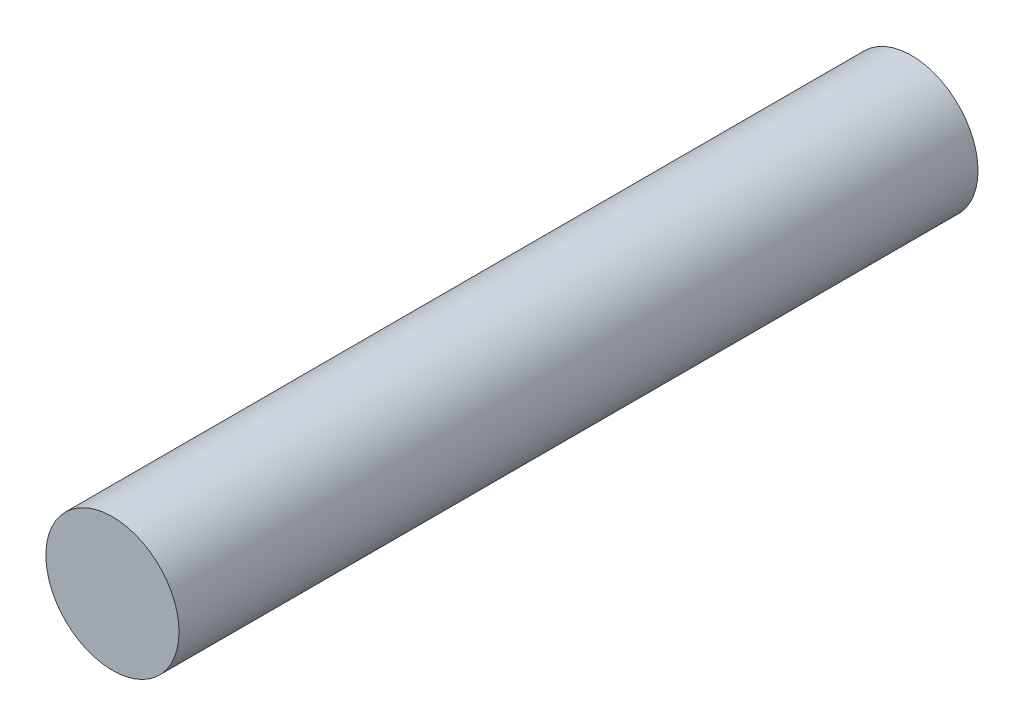
ISO-10303-21;
HEADER;
FILE_DESCRIPTION(('STEP AP214'),'2;1');
FILE_NAME('part.step','',(''),(''),'','','');
FILE_SCHEMA(('AUTOMOTIVE_DESIGN { 1 0 10303 214 1 1 1 1 }'));
ENDSEC;
DATA;
#1=APPLICATION_CONTEXT('core data for automotive mechanical design processes');
#2=APPLICATION_PROTOCOL_DEFINITION('international standard','automotive_design',2000,#1);
#3=PRODUCT_CONTEXT('',#1,'mechanical');
#4=PRODUCT('Part','Part','',(#3));
#5=PRODUCT_RELATED_PRODUCT_CATEGORY('part','',(#4));
#6=PRODUCT_DEFINITION_FORMATION('','',#4);
#7=PRODUCT_DEFINITION_CONTEXT('part definition',#1,'design');
#8=PRODUCT_DEFINITION('design','',#6,#7);
#9=PRODUCT_DEFINITION_SHAPE('','',#8);
#10=(LENGTH_UNIT() NAMED_UNIT(*) SI_UNIT(.MILLI.,.METRE.));
#11=(NAMED_UNIT(*) PLANE_ANGLE_UNIT() SI_UNIT($,.RADIAN.));
#12=(NAMED_UNIT(*) SI_UNIT($,.STERADIAN.) SOLID_ANGLE_UNIT());
#13=UNCERTAINTY_MEASURE_WITH_UNIT(LENGTH_MEASURE(1.E-05),#10,'distance_accuracy_value','');
#14=(GEOMETRIC_REPRESENTATION_CONTEXT(3) GLOBAL_UNCERTAINTY_ASSIGNED_CONTEXT((#13)) GLOBAL_UNIT_ASSIGNED_CONTEXT((#10,
#11,#12)) REPRESENTATION_CONTEXT('',''));
#15=CARTESIAN_POINT('',(0.,0.,0.));
#16=DIRECTION('',(0.,0.,1.));
#17=DIRECTION('',(1.,0.,0.));
#18=AXIS2_PLACEMENT_3D('',#15,#16,#17);
#19=CARTESIAN_POINT('',(0.,0.,38.1));
#20=DIRECTION('',(0.,0.,-1.));
#21=DIRECTION('',(-1.,0.,0.));
#22=AXIS2_PLACEMENT_3D('',#19,#20,#21);
#23=CYLINDRICAL_SURFACE('',#22,3.175);
#24=CARTESIAN_POINT('',(0.,0.,38.1));
#25=DIRECTION('',(0.,0.,1.));
#26=DIRECTION('',(1.,0.,0.));
#27=AXIS2_PLACEMENT_3D('',#24,#25,#26);
#28=CIRCLE('',#27,3.175);
#29=CARTESIAN_POINT('',(3.175,0.,38.1));
#30=VERTEX_POINT('',#29);
#31=EDGE_CURVE('E10',#30,#30,#28,.T.);
#32=ORIENTED_EDGE('',*,*,#31,.F.);
#33=EDGE_LOOP('',(#32));
#34=FACE_BOUND('',#33,.T.);
#35=CARTESIAN_POINT('',(0.,0.,0.));
#36=DIRECTION('',(0.,0.,1.));
#37=DIRECTION('',(1.,0.,0.));
#38=AXIS2_PLACEMENT_3D('',#35,#36,#37);
#39=CIRCLE('',#38,3.175);
#40=CARTESIAN_POINT('',(3.175,0.,0.));
#41=VERTEX_POINT('',#40);
#42=EDGE_CURVE('E33',#41,#41,#39,.T.);
#43=ORIENTED_EDGE('',*,*,#42,.T.);
#44=EDGE_LOOP('',(#43));
#45=FACE_BOUND('',#44,.T.);
#46=ADVANCED_FACE('F30',(#34,#45),#23,.T.);
#47=CARTESIAN_POINT('',(0.,0.,38.1));
#48=DIRECTION('',(0.,0.,1.));
#49=DIRECTION('',(1.,0.,0.));
#50=AXIS2_PLACEMENT_3D('',#47,#48,#49);
#51=PLANE('',#50);
#52=ORIENTED_EDGE('',*,*,#31,.T.);
#53=EDGE_LOOP('',(#52));
#54=FACE_BOUND('',#53,.T.);
#55=ADVANCED_FACE('F45',(#54),#51,.T.);
#56=CARTESIAN_POINT('',(0.,0.,0.));
#57=DIRECTION('',(0.,0.,1.));
#58=DIRECTION('',(1.,0.,0.));
#59=AXIS2_PLACEMENT_3D('',#56,#57,#58);
#60=PLANE('',#59);
#61=ORIENTED_EDGE('',*,*,#42,.F.);
#62=EDGE_LOOP('',(#61));
#63=FACE_BOUND('',#62,.T.);
#64=ADVANCED_FACE('F43',(#63),#60,.F.);
#65=CLOSED_SHELL('',(#46,#55,#64));
#66=MANIFOLD_SOLID_BREP('B2',#65);
#67=ADVANCED_BREP_SHAPE_REPRESENTATION('',(#18,#66),#14);
#68=SHAPE_DEFINITION_REPRESENTATION(#9,#67);
ENDSEC;
END-ISO-10303-21;
